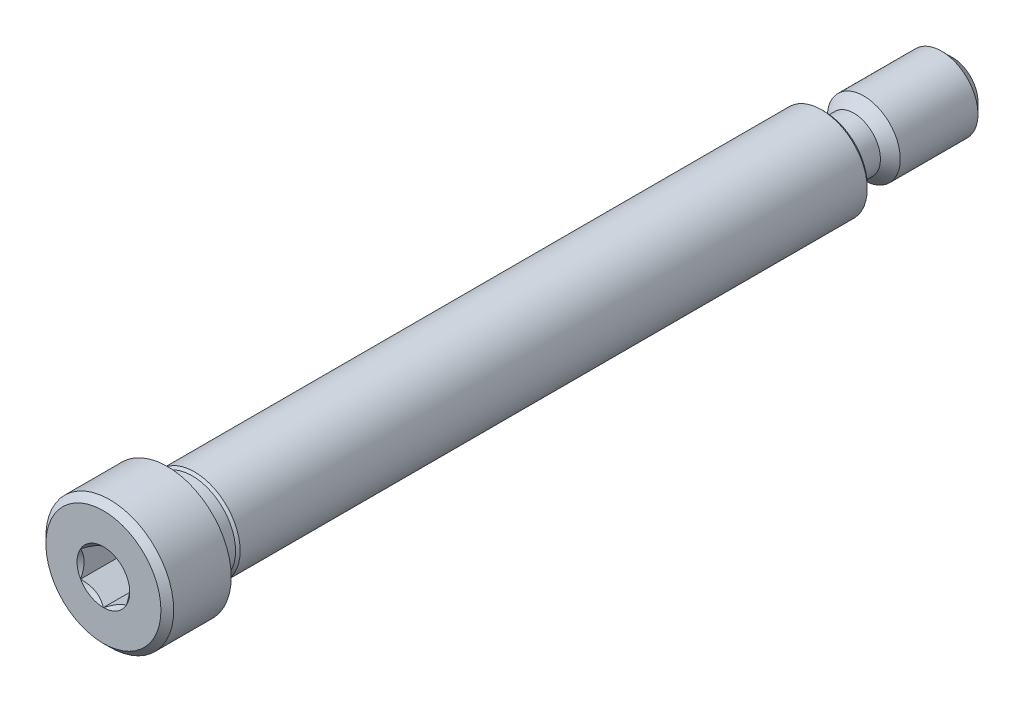
ISO-10303-21;
HEADER;
FILE_DESCRIPTION(('STEP AP214'),'2;1');
FILE_NAME('part.step','',(''),(''),'','','');
FILE_SCHEMA(('AUTOMOTIVE_DESIGN { 1 0 10303 214 1 1 1 1 }'));
ENDSEC;
DATA;
#1=APPLICATION_CONTEXT('core data for automotive mechanical design processes');
#2=APPLICATION_PROTOCOL_DEFINITION('international standard','automotive_design',2000,#1);
#3=PRODUCT_CONTEXT('',#1,'mechanical');
#4=PRODUCT('Part','Part','',(#3));
#5=PRODUCT_RELATED_PRODUCT_CATEGORY('part','',(#4));
#6=PRODUCT_DEFINITION_FORMATION('','',#4);
#7=PRODUCT_DEFINITION_CONTEXT('part definition',#1,'design');
#8=PRODUCT_DEFINITION('design','',#6,#7);
#9=PRODUCT_DEFINITION_SHAPE('','',#8);
#10=(LENGTH_UNIT() NAMED_UNIT(*) SI_UNIT(.MILLI.,.METRE.));
#11=(NAMED_UNIT(*) PLANE_ANGLE_UNIT() SI_UNIT($,.RADIAN.));
#12=(NAMED_UNIT(*) SI_UNIT($,.STERADIAN.) SOLID_ANGLE_UNIT());
#13=UNCERTAINTY_MEASURE_WITH_UNIT(LENGTH_MEASURE(1.E-05),#10,'distance_accuracy_value','');
#14=(GEOMETRIC_REPRESENTATION_CONTEXT(3) GLOBAL_UNCERTAINTY_ASSIGNED_CONTEXT((#13)) GLOBAL_UNIT_ASSIGNED_CONTEXT((#10,
#11,#12)) REPRESENTATION_CONTEXT('',''));
#15=CARTESIAN_POINT('',(0.,0.,0.));
#16=DIRECTION('',(0.,0.,1.));
#17=DIRECTION('',(1.,0.,0.));
#18=AXIS2_PLACEMENT_3D('',#15,#16,#17);
#19=CARTESIAN_POINT('',(0.,5.000625,36.909375));
#20=DIRECTION('',(0.,0.,-1.));
#21=DIRECTION('',(-1.,0.,0.));
#22=AXIS2_PLACEMENT_3D('',#19,#20,#21);
#23=PLANE('',#22);
#24=CARTESIAN_POINT('',(0.,0.,36.909375));
#25=DIRECTION('',(0.,0.,1.));
#26=DIRECTION('',(1.,0.,0.));
#27=AXIS2_PLACEMENT_3D('',#24,#25,#26);
#28=CIRCLE('',#27,2.29135888084633);
#29=CARTESIAN_POINT('',(-1.984375,1.14567944042316,36.909375));
#30=VERTEX_POINT('',#29);
#31=CARTESIAN_POINT('',(-1.984375,-1.14567944042316,36.909375));
#32=VERTEX_POINT('',#31);
#33=EDGE_CURVE('E132',#30,#32,#28,.T.);
#34=ORIENTED_EDGE('',*,*,#33,.F.);
#35=CARTESIAN_POINT('',(0.,2.29135888084633,36.909375));
#36=VERTEX_POINT('',#35);
#37=EDGE_CURVE('E127',#36,#30,#28,.T.);
#38=ORIENTED_EDGE('',*,*,#37,.F.);
#39=CARTESIAN_POINT('',(1.984375,1.14567944042317,36.909375));
#40=VERTEX_POINT('',#39);
#41=EDGE_CURVE('E99',#40,#36,#28,.T.);
#42=ORIENTED_EDGE('',*,*,#41,.F.);
#43=CARTESIAN_POINT('',(1.984375,-1.14567944042317,36.909375));
#44=VERTEX_POINT('',#43);
#45=EDGE_CURVE('E89',#44,#40,#28,.T.);
#46=ORIENTED_EDGE('',*,*,#45,.F.);
#47=CARTESIAN_POINT('',(0.,-2.29135888084633,36.909375));
#48=VERTEX_POINT('',#47);
#49=EDGE_CURVE('E50',#48,#44,#28,.T.);
#50=ORIENTED_EDGE('',*,*,#49,.F.);
#51=EDGE_CURVE('E57',#32,#48,#28,.T.);
#52=ORIENTED_EDGE('',*,*,#51,.F.);
#53=EDGE_LOOP('',(#34,#38,#42,#46,#50,#52));
#54=FACE_BOUND('',#53,.T.);
#55=CARTESIAN_POINT('',(0.,0.,36.909375));
#56=DIRECTION('',(0.,0.,1.));
#57=DIRECTION('',(1.,0.,0.));
#58=AXIS2_PLACEMENT_3D('',#55,#56,#57);
#59=CIRCLE('',#58,5.000625);
#60=CARTESIAN_POINT('',(5.000625,0.,36.909375));
#61=VERTEX_POINT('',#60);
#62=EDGE_CURVE('E44',#61,#61,#59,.T.);
#63=ORIENTED_EDGE('',*,*,#62,.T.);
#64=EDGE_LOOP('',(#63));
#65=FACE_BOUND('',#64,.T.);
#66=ADVANCED_FACE('F36',(#54,#65),#23,.F.);
#67=CARTESIAN_POINT('',(0.,0.,36.35375));
#68=DIRECTION('',(0.,0.,-1.));
#69=DIRECTION('',(-1.,0.,0.));
#70=AXIS2_PLACEMENT_3D('',#67,#68,#69);
#71=CONICAL_SURFACE('',#70,5.55625,0.785398163397445);
#72=ORIENTED_EDGE('',*,*,#62,.F.);
#73=EDGE_LOOP('',(#72));
#74=FACE_BOUND('',#73,.T.);
#75=CARTESIAN_POINT('',(0.,0.,36.35375));
#76=DIRECTION('',(0.,0.,1.));
#77=DIRECTION('',(1.,0.,0.));
#78=AXIS2_PLACEMENT_3D('',#75,#76,#77);
#79=CIRCLE('',#78,5.55625);
#80=CARTESIAN_POINT('',(5.55625,0.,36.35375));
#81=VERTEX_POINT('',#80);
#82=EDGE_CURVE('E301',#81,#81,#79,.T.);
#83=ORIENTED_EDGE('',*,*,#82,.T.);
#84=EDGE_LOOP('',(#83));
#85=FACE_BOUND('',#84,.T.);
#86=ADVANCED_FACE('F204',(#74,#85),#71,.T.);
#87=CARTESIAN_POINT('',(0.,0.,36.909375));
#88=DIRECTION('',(0.,0.,1.));
#89=DIRECTION('',(1.,0.,0.));
#90=AXIS2_PLACEMENT_3D('',#87,#88,#89);
#91=CYLINDRICAL_SURFACE('',#90,5.55625);
#92=ORIENTED_EDGE('',*,*,#82,.F.);
#93=EDGE_LOOP('',(#92));
#94=FACE_BOUND('',#93,.T.);
#95=CARTESIAN_POINT('',(0.,0.,31.353125));
#96=DIRECTION('',(0.,0.,1.));
#97=DIRECTION('',(1.,0.,0.));
#98=AXIS2_PLACEMENT_3D('',#95,#96,#97);
#99=CIRCLE('',#98,5.55625);
#100=CARTESIAN_POINT('',(5.55625,0.,31.353125));
#101=VERTEX_POINT('',#100);
#102=EDGE_CURVE('E298',#101,#101,#99,.T.);
#103=ORIENTED_EDGE('',*,*,#102,.T.);
#104=EDGE_LOOP('',(#103));
#105=FACE_BOUND('',#104,.T.);
#106=ADVANCED_FACE('F208',(#94,#105),#91,.T.);
#107=CARTESIAN_POINT('',(0.,5.55625,31.353125));
#108=DIRECTION('',(0.,0.,1.));
#109=DIRECTION('',(1.,0.,0.));
#110=AXIS2_PLACEMENT_3D('',#107,#108,#109);
#111=PLANE('',#110);
#112=ORIENTED_EDGE('',*,*,#102,.F.);
#113=EDGE_LOOP('',(#112));
#114=FACE_BOUND('',#113,.T.);
#115=CARTESIAN_POINT('',(0.,0.,31.353125));
#116=DIRECTION('',(0.,0.,1.));
#117=DIRECTION('',(1.,0.,0.));
#118=AXIS2_PLACEMENT_3D('',#115,#116,#117);
#119=CIRCLE('',#118,3.96875);
#120=CARTESIAN_POINT('',(3.96875,0.,31.353125));
#121=VERTEX_POINT('',#120);
#122=EDGE_CURVE('E295',#121,#121,#119,.T.);
#123=ORIENTED_EDGE('',*,*,#122,.T.);
#124=EDGE_LOOP('',(#123));
#125=FACE_BOUND('',#124,.T.);
#126=ADVANCED_FACE('F213',(#114,#125),#111,.F.);
#127=CARTESIAN_POINT('',(0.,0.,31.1546875));
#128=DIRECTION('',(0.,0.,1.));
#129=DIRECTION('',(1.,0.,0.));
#130=AXIS2_PLACEMENT_3D('',#127,#128,#129);
#131=CONICAL_SURFACE('',#130,3.7703125,0.785398163397443);
#132=ORIENTED_EDGE('',*,*,#122,.F.);
#133=EDGE_LOOP('',(#132));
#134=FACE_BOUND('',#133,.T.);
#135=CARTESIAN_POINT('',(0.,0.,31.1546875));
#136=DIRECTION('',(0.,0.,1.));
#137=DIRECTION('',(1.,0.,0.));
#138=AXIS2_PLACEMENT_3D('',#135,#136,#137);
#139=CIRCLE('',#138,3.7703125);
#140=CARTESIAN_POINT('',(3.7703125,0.,31.1546875));
#141=VERTEX_POINT('',#140);
#142=EDGE_CURVE('E292',#141,#141,#139,.T.);
#143=ORIENTED_EDGE('',*,*,#142,.T.);
#144=EDGE_LOOP('',(#143));
#145=FACE_BOUND('',#144,.T.);
#146=ADVANCED_FACE('F221',(#134,#145),#131,.T.);
#147=CARTESIAN_POINT('',(0.,0.,36.909375));
#148=DIRECTION('',(0.,0.,1.));
#149=DIRECTION('',(1.,0.,0.));
#150=AXIS2_PLACEMENT_3D('',#147,#148,#149);
#151=CYLINDRICAL_SURFACE('',#150,3.7703125);
#152=ORIENTED_EDGE('',*,*,#142,.F.);
#153=EDGE_LOOP('',(#152));
#154=FACE_BOUND('',#153,.T.);
#155=CARTESIAN_POINT('',(0.,0.,29.1893625));
#156=DIRECTION('',(0.,0.,1.));
#157=DIRECTION('',(1.,0.,0.));
#158=AXIS2_PLACEMENT_3D('',#155,#156,#157);
#159=CIRCLE('',#158,3.7703125);
#160=CARTESIAN_POINT('',(3.7703125,0.,29.1893625));
#161=VERTEX_POINT('',#160);
#162=EDGE_CURVE('E289',#161,#161,#159,.T.);
#163=ORIENTED_EDGE('',*,*,#162,.T.);
#164=EDGE_LOOP('',(#163));
#165=FACE_BOUND('',#164,.T.);
#166=ADVANCED_FACE('F225',(#154,#165),#151,.T.);
#167=CARTESIAN_POINT('',(0.,0.,28.990925));
#168=DIRECTION('',(0.,0.,-1.));
#169=DIRECTION('',(-1.,0.,0.));
#170=AXIS2_PLACEMENT_3D('',#167,#168,#169);
#171=CONICAL_SURFACE('',#170,3.96875,0.785398163397442);
#172=ORIENTED_EDGE('',*,*,#162,.F.);
#173=EDGE_LOOP('',(#172));
#174=FACE_BOUND('',#173,.T.);
#175=CARTESIAN_POINT('',(0.,0.,28.990925));
#176=DIRECTION('',(0.,0.,1.));
#177=DIRECTION('',(1.,0.,0.));
#178=AXIS2_PLACEMENT_3D('',#175,#176,#177);
#179=CIRCLE('',#178,3.96875);
#180=CARTESIAN_POINT('',(3.96875,0.,28.990925));
#181=VERTEX_POINT('',#180);
#182=EDGE_CURVE('E286',#181,#181,#179,.T.);
#183=ORIENTED_EDGE('',*,*,#182,.T.);
#184=EDGE_LOOP('',(#183));
#185=FACE_BOUND('',#184,.T.);
#186=ADVANCED_FACE('F229',(#174,#185),#171,.T.);
#187=CARTESIAN_POINT('',(0.,0.,36.909375));
#188=DIRECTION('',(0.,0.,1.));
#189=DIRECTION('',(1.,0.,0.));
#190=AXIS2_PLACEMENT_3D('',#187,#188,#189);
#191=CYLINDRICAL_SURFACE('',#190,3.96875);
#192=ORIENTED_EDGE('',*,*,#182,.F.);
#193=EDGE_LOOP('',(#192));
#194=FACE_BOUND('',#193,.T.);
#195=CARTESIAN_POINT('',(0.,0.,-25.5322916666667));
#196=DIRECTION('',(0.,0.,1.));
#197=DIRECTION('',(1.,0.,0.));
#198=AXIS2_PLACEMENT_3D('',#195,#196,#197);
#199=CIRCLE('',#198,3.96875);
#200=CARTESIAN_POINT('',(3.96875,0.,-25.5322916666667));
#201=VERTEX_POINT('',#200);
#202=EDGE_CURVE('E283',#201,#201,#199,.T.);
#203=ORIENTED_EDGE('',*,*,#202,.T.);
#204=EDGE_LOOP('',(#203));
#205=FACE_BOUND('',#204,.T.);
#206=ADVANCED_FACE('F233',(#194,#205),#191,.T.);
#207=CARTESIAN_POINT('',(0.,0.,-25.796875));
#208=DIRECTION('',(0.,0.,1.));
#209=DIRECTION('',(1.,0.,0.));
#210=AXIS2_PLACEMENT_3D('',#207,#208,#209);
#211=CONICAL_SURFACE('',#210,3.70416666666667,0.785398163397452);
#212=ORIENTED_EDGE('',*,*,#202,.F.);
#213=EDGE_LOOP('',(#212));
#214=FACE_BOUND('',#213,.T.);
#215=CARTESIAN_POINT('',(0.,0.,-25.796875));
#216=DIRECTION('',(0.,0.,1.));
#217=DIRECTION('',(1.,0.,0.));
#218=AXIS2_PLACEMENT_3D('',#215,#216,#217);
#219=CIRCLE('',#218,3.70416666666667);
#220=CARTESIAN_POINT('',(3.70416666666667,0.,-25.796875));
#221=VERTEX_POINT('',#220);
#222=EDGE_CURVE('E271',#221,#221,#219,.T.);
#223=ORIENTED_EDGE('',*,*,#222,.T.);
#224=EDGE_LOOP('',(#223));
#225=FACE_BOUND('',#224,.T.);
#226=ADVANCED_FACE('F237',(#214,#225),#211,.T.);
#227=CARTESIAN_POINT('',(0.,3.70416666666667,-25.796875));
#228=DIRECTION('',(0.,0.,1.));
#229=DIRECTION('',(1.,0.,0.));
#230=AXIS2_PLACEMENT_3D('',#227,#228,#229);
#231=PLANE('',#230);
#232=CARTESIAN_POINT('',(0.,0.,-25.796875));
#233=DIRECTION('',(0.,0.,-1.));
#234=DIRECTION('',(-1.,0.,0.));
#235=AXIS2_PLACEMENT_3D('',#232,#233,#234);
#236=CIRCLE('',#235,3.175);
#237=CARTESIAN_POINT('',(-3.175,0.,-25.796875));
#238=VERTEX_POINT('',#237);
#239=EDGE_CURVE('E527',#238,#238,#236,.T.);
#240=ORIENTED_EDGE('',*,*,#239,.F.);
#241=EDGE_LOOP('',(#240));
#242=FACE_BOUND('',#241,.T.);
#243=ORIENTED_EDGE('',*,*,#222,.F.);
#244=EDGE_LOOP('',(#243));
#245=FACE_BOUND('',#244,.T.);
#246=ADVANCED_FACE('F241',(#242,#245),#231,.F.);
#247=CARTESIAN_POINT('',(0.,0.,36.909375));
#248=DIRECTION('',(0.,0.,1.));
#249=DIRECTION('',(1.,0.,0.));
#250=AXIS2_PLACEMENT_3D('',#247,#248,#249);
#251=CONICAL_SURFACE('',#250,2.29135888084633,0.78539816339745);
#252=ORIENTED_EDGE('',*,*,#41,.T.);
#253=CARTESIAN_POINT('',(1.984575,1.14556397036933,36.9094904787818));
#254=CARTESIAN_POINT('',(1.91635900483319,1.18494849354192,36.8701378522639));
#255=CARTESIAN_POINT('',(1.84700231489303,1.22499159714897,36.8330963104462));
#256=CARTESIAN_POINT('',(1.70557619954781,1.30664400291398,36.7652738584233));
#257=CARTESIAN_POINT('',(1.63349332126322,1.34826107209555,36.7345306890918));
#258=CARTESIAN_POINT('',(1.488141602734,1.43217992591557,36.6818668888112));
#259=CARTESIAN_POINT('',(1.41490978751306,1.47446033414663,36.65981387588));
#260=CARTESIAN_POINT('',(1.2668338174053,1.55995203534886,36.6258364929439));
#261=CARTESIAN_POINT('',(1.19199418724658,1.60316071596705,36.6138867560917));
#262=CARTESIAN_POINT('',(1.06301458545619,1.6776271237807,36.6031050990819));
#263=CARTESIAN_POINT('',(1.00904128422756,1.7087886237741,36.6015088990591));
#264=CARTESIAN_POINT('',(0.9011828814802,1.77106070163465,36.6041968388653));
#265=CARTESIAN_POINT('',(0.847297817514477,1.80217125782056,36.6084830403405));
#266=CARTESIAN_POINT('',(0.740036461751397,1.86409863044402,36.6226918730135));
#267=CARTESIAN_POINT('',(0.68666080723986,1.89491507894443,36.6326208104523));
#268=CARTESIAN_POINT('',(0.580832482591104,1.95601509066828,36.6575700842745));
#269=CARTESIAN_POINT('',(0.528379742028899,1.9862986945516,36.6725900303895));
#270=CARTESIAN_POINT('',(0.394017661036352,2.06387267818152,36.7171828516357));
#271=CARTESIAN_POINT('',(0.312941642841677,2.11068193911104,36.7501179959383));
#272=CARTESIAN_POINT('',(0.193726693270163,2.17951072233758,36.8057174412022));
#273=CARTESIAN_POINT('',(0.154440075614001,2.20219286161692,36.8252525920519));
#274=CARTESIAN_POINT('',(0.0765946381319502,2.24713694590237,36.8661037381194));
#275=CARTESIAN_POINT('',(0.0380353888983047,2.26939913882716,36.8874186395684));
#276=CARTESIAN_POINT('',(-0.000199999999996856,2.29147435090016,36.9094904787818));
#277=B_SPLINE_CURVE_WITH_KNOTS('',3,(#253,#254,#255,#256,#257,#258,#259,#260,#261,#262,#263,
#264,#265,#266,#267,#268,#269,#270,#271,#272,#273,#274,#275,#276),.UNSPECIFIED.,.F.,.F.,(4,2,2,
2,2,2,2,2,2,2,2,4),(0.,0.264339630306627,0.530219665093692,0.791876416371457,1.05287424418109,
1.239639843932,1.42647091743852,1.61351120244034,1.8005371524754,2.09764209964316,
2.24579179873713,2.39385111134157),.UNSPECIFIED.);
#278=EDGE_CURVE('E11',#40,#36,#277,.T.);
#279=ORIENTED_EDGE('',*,*,#278,.F.);
#280=EDGE_LOOP('',(#252,#279));
#281=FACE_BOUND('',#280,.T.);
#282=ADVANCED_FACE('F102',(#281),#251,.F.);
#283=ORIENTED_EDGE('',*,*,#37,.T.);
#284=CARTESIAN_POINT('',(0.000200000000000114,2.29147435090017,36.9094904787818));
#285=CARTESIAN_POINT('',(-0.0680159951668045,2.25208982772757,36.8701378522639));
#286=CARTESIAN_POINT('',(-0.137372685106969,2.21204672412052,36.8330963104462));
#287=CARTESIAN_POINT('',(-0.278798800452189,2.13039431835551,36.7652738584233));
#288=CARTESIAN_POINT('',(-0.350881678736783,2.08877724917394,36.7345306890918));
#289=CARTESIAN_POINT('',(-0.496233397266004,2.00485839535392,36.6818668888112));
#290=CARTESIAN_POINT('',(-0.569465212486938,1.96257798712287,36.65981387588));
#291=CARTESIAN_POINT('',(-0.717541182594707,1.87708628592063,36.6258364929439));
#292=CARTESIAN_POINT('',(-0.792380812753425,1.83387760530244,36.6138867560917));
#293=CARTESIAN_POINT('',(-0.921360414543817,1.75941119748879,36.6031050990819));
#294=CARTESIAN_POINT('',(-0.975333715772444,1.72824969749539,36.6015088990591));
#295=CARTESIAN_POINT('',(-1.0831921185198,1.66597761963484,36.6041968388653));
#296=CARTESIAN_POINT('',(-1.13707718248552,1.63486706344893,36.6084830403405));
#297=CARTESIAN_POINT('',(-1.24433853824861,1.57293969082547,36.6226918730135));
#298=CARTESIAN_POINT('',(-1.29771419276014,1.54212324232506,36.6326208104523));
#299=CARTESIAN_POINT('',(-1.4035425174089,1.48102323060122,36.6575700842745));
#300=CARTESIAN_POINT('',(-1.4559952579711,1.45073962671789,36.6725900303895));
#301=CARTESIAN_POINT('',(-1.59035733896365,1.37316564308797,36.7171828516357));
#302=CARTESIAN_POINT('',(-1.67143335715833,1.32635638215845,36.7501179959383));
#303=CARTESIAN_POINT('',(-1.79064830672984,1.25752759893191,36.8057174412022));
#304=CARTESIAN_POINT('',(-1.829934924386,1.23484545965257,36.8252525920519));
#305=CARTESIAN_POINT('',(-1.90778036186805,1.18990137536713,36.8661037381194));
#306=CARTESIAN_POINT('',(-1.9463396111017,1.16763918244233,36.8874186395684));
#307=CARTESIAN_POINT('',(-1.984575,1.14556397036933,36.9094904787818));
#308=B_SPLINE_CURVE_WITH_KNOTS('',3,(#284,#285,#286,#287,#288,#289,#290,#291,#292,#293,#294,
#295,#296,#297,#298,#299,#300,#301,#302,#303,#304,#305,#306,#307),.UNSPECIFIED.,.F.,.F.,(4,2,2,
2,2,2,2,2,2,2,2,4),(0.,0.264339630306628,0.530219665093694,0.79187641637146,1.05287424418109,
1.239639843932,1.42647091743852,1.61351120244035,1.8005371524754,2.09764209964317,
2.24579179873714,2.39385111134157),.UNSPECIFIED.);
#309=EDGE_CURVE('E128',#36,#30,#308,.T.);
#310=ORIENTED_EDGE('',*,*,#309,.F.);
#311=EDGE_LOOP('',(#283,#310));
#312=FACE_BOUND('',#311,.T.);
#313=ADVANCED_FACE('F334',(#312),#251,.F.);
#314=ORIENTED_EDGE('',*,*,#33,.T.);
#315=CARTESIAN_POINT('',(-1.984375,-2.28495242157822,37.6443590788166));
#316=CARTESIAN_POINT('',(-1.984375,-2.22931635455401,37.6023616855508));
#317=CARTESIAN_POINT('',(-1.984375,-2.17336876548389,37.5607710540763));
#318=CARTESIAN_POINT('',(-1.984375,-2.0607277025817,37.4785834614715));
#319=CARTESIAN_POINT('',(-1.984375,-2.00403404503434,37.437986752405));
#320=CARTESIAN_POINT('',(-1.984375,-1.88936329173488,37.3576785031747));
#321=CARTESIAN_POINT('',(-1.984375,-1.83137965519348,37.3179762588133));
#322=CARTESIAN_POINT('',(-1.984375,-1.7144280213784,37.2400601734013));
#323=CARTESIAN_POINT('',(-1.984375,-1.65546009407228,37.2018462271944));
#324=CARTESIAN_POINT('',(-1.984375,-1.47005472306035,37.0856278340136));
#325=CARTESIAN_POINT('',(-1.984375,-1.34163909427883,37.0107228868724));
#326=CARTESIAN_POINT('',(-1.984375,-1.07840384705479,36.8737052154397));
#327=CARTESIAN_POINT('',(-1.984375,-0.943607781407422,36.8115493664824));
#328=CARTESIAN_POINT('',(-1.984375,-0.74127510044488,36.7355075786886));
#329=CARTESIAN_POINT('',(-1.984375,-0.676735408881094,36.713683061326));
#330=CARTESIAN_POINT('',(-1.984375,-0.54609811811276,36.6752154635378));
#331=CARTESIAN_POINT('',(-1.984375,-0.480000411919954,36.6585727400656));
#332=CARTESIAN_POINT('',(-1.984375,-0.347746170028529,36.6316103808697));
#333=CARTESIAN_POINT('',(-1.984375,-0.281612071479119,36.6211824097359));
#334=CARTESIAN_POINT('',(-1.984375,-0.148636620052346,36.6068531473766));
#335=CARTESIAN_POINT('',(-1.984375,-0.0817953907393188,36.6029507342274));
#336=CARTESIAN_POINT('',(-1.984375,0.0495156750890701,36.6019620513327));
#337=CARTESIAN_POINT('',(-1.984375,0.113983775102997,36.604634178875));
#338=CARTESIAN_POINT('',(-1.984375,0.242367515846183,36.6161142104975));
#339=CARTESIAN_POINT('',(-1.984375,0.306283102295925,36.6249227106392));
#340=CARTESIAN_POINT('',(-1.984375,0.43418104026219,36.6483440213329));
#341=CARTESIAN_POINT('',(-1.984375,0.498145026858316,36.6630556062321));
#342=CARTESIAN_POINT('',(-1.984375,0.624675616953013,36.6975011814121));
#343=CARTESIAN_POINT('',(-1.984375,0.687242336899694,36.7172347514492));
#344=CARTESIAN_POINT('',(-1.984375,0.884225483826092,36.7867872372308));
#345=CARTESIAN_POINT('',(-1.984375,1.01583674256469,36.8445274112565));
#346=CARTESIAN_POINT('',(-1.984375,1.27288659242652,36.9729053365888));
#347=CARTESIAN_POINT('',(-1.984375,1.3983008827048,37.0435894249194));
#348=CARTESIAN_POINT('',(-1.984375,1.57956687990222,37.1538916638132));
#349=CARTESIAN_POINT('',(-1.984375,1.63738271299425,37.1903448294754));
#350=CARTESIAN_POINT('',(-1.984375,1.75202215386203,37.2647909632917));
#351=CARTESIAN_POINT('',(-1.984375,1.80884568601363,37.3027840480781));
#352=CARTESIAN_POINT('',(-1.984375,1.92116923084256,37.3797138088931));
#353=CARTESIAN_POINT('',(-1.984375,1.97667624512255,37.4186403130388));
#354=CARTESIAN_POINT('',(-1.984375,2.08693170717168,37.4975227461214));
#355=CARTESIAN_POINT('',(-1.984375,2.14168035934794,37.537478389024));
#356=CARTESIAN_POINT('',(-1.984375,2.19611149046623,37.5778556112854));
#357=B_SPLINE_CURVE_WITH_KNOTS('',3,(#315,#316,#317,#318,#319,#320,#321,#322,#323,#324,#325,
#326,#327,#328,#329,#330,#331,#332,#333,#334,#335,#336,#337,#338,#339,#340,#341,#342,#343,#344,
#345,#346,#347,#348,#349,#350,#351,#352,#353,#354,#355,#356),.UNSPECIFIED.,.F.,.F.,(4,2,2,2,2,2,
2,2,2,2,2,2,2,2,2,2,2,2,2,2,4),(0.,0.209126070008321,0.418304637356568,0.629103979977992,
0.839888401371176,1.28549951116127,1.72957750768351,1.93379389749971,2.13802435186698,
2.33858179514333,2.53910475350639,2.73236963400794,2.92565329006887,3.12231577097487,
3.31896180041345,3.74886295245172,4.18033428125363,4.3853601718029,4.59040161996383,
4.79377749165109,4.99709743524132),.UNSPECIFIED.);
#358=EDGE_CURVE('E130',#30,#32,#357,.F.);
#359=ORIENTED_EDGE('',*,*,#358,.F.);
#360=EDGE_LOOP('',(#314,#359));
#361=FACE_BOUND('',#360,.T.);
#362=ADVANCED_FACE('F327',(#361),#251,.F.);
#363=ORIENTED_EDGE('',*,*,#51,.T.);
#364=CARTESIAN_POINT('',(-1.984575,-1.14556397036933,36.9094904787818));
#365=CARTESIAN_POINT('',(-1.9163590048332,-1.18494849354192,36.8701378522639));
#366=CARTESIAN_POINT('',(-1.84700231489303,-1.22499159714897,36.8330963104462));
#367=CARTESIAN_POINT('',(-1.70557619954781,-1.30664400291398,36.7652738584233));
#368=CARTESIAN_POINT('',(-1.63349332126322,-1.34826107209555,36.7345306890918));
#369=CARTESIAN_POINT('',(-1.488141602734,-1.43217992591557,36.6818668888112));
#370=CARTESIAN_POINT('',(-1.41490978751306,-1.47446033414663,36.65981387588));
#371=CARTESIAN_POINT('',(-1.26683381740529,-1.55995203534886,36.6258364929439));
#372=CARTESIAN_POINT('',(-1.19199418724657,-1.60316071596705,36.6138867560917));
#373=CARTESIAN_POINT('',(-1.06301458545618,-1.6776271237807,36.6031050990819));
#374=CARTESIAN_POINT('',(-1.00904128422755,-1.7087886237741,36.6015088990591));
#375=CARTESIAN_POINT('',(-0.901182881480196,-1.77106070163465,36.6041968388653));
#376=CARTESIAN_POINT('',(-0.847297817514473,-1.80217125782056,36.6084830403405));
#377=CARTESIAN_POINT('',(-0.740036461751393,-1.86409863044402,36.6226918730135));
#378=CARTESIAN_POINT('',(-0.686660807239856,-1.89491507894443,36.6326208104523));
#379=CARTESIAN_POINT('',(-0.5808324825911,-1.95601509066828,36.6575700842745));
#380=CARTESIAN_POINT('',(-0.528379742028895,-1.9862986945516,36.6725900303895));
#381=CARTESIAN_POINT('',(-0.394017661036349,-2.06387267818153,36.7171828516357));
#382=CARTESIAN_POINT('',(-0.312941642841674,-2.11068193911104,36.7501179959383));
#383=CARTESIAN_POINT('',(-0.193726693270161,-2.17951072233758,36.8057174412022));
#384=CARTESIAN_POINT('',(-0.154440075614,-2.20219286161692,36.8252525920519));
#385=CARTESIAN_POINT('',(-0.0765946381319492,-2.24713694590237,36.8661037381194));
#386=CARTESIAN_POINT('',(-0.0380353888983039,-2.26939913882716,36.8874186395683));
#387=CARTESIAN_POINT('',(0.000199999999997345,-2.29147435090016,36.9094904787818));
#388=B_SPLINE_CURVE_WITH_KNOTS('',3,(#364,#365,#366,#367,#368,#369,#370,#371,#372,#373,#374,
#375,#376,#377,#378,#379,#380,#381,#382,#383,#384,#385,#386,#387),.UNSPECIFIED.,.F.,.F.,(4,2,2,
2,2,2,2,2,2,2,2,4),(0.,0.264339630306628,0.530219665093695,0.791876416371461,1.05287424418109,
1.239639843932,1.42647091743853,1.61351120244035,1.80053715247541,2.09764209964316,
2.24579179873713,2.39385111134157),.UNSPECIFIED.);
#389=EDGE_CURVE('E170',#32,#48,#388,.T.);
#390=ORIENTED_EDGE('',*,*,#389,.F.);
#391=EDGE_LOOP('',(#363,#390));
#392=FACE_BOUND('',#391,.T.);
#393=ADVANCED_FACE('F328',(#392),#251,.F.);
#394=ORIENTED_EDGE('',*,*,#49,.T.);
#395=CARTESIAN_POINT('',(-0.000200000000000085,-2.29147435090017,36.9094904787818));
#396=CARTESIAN_POINT('',(0.0680159951668043,-2.25208982772757,36.8701378522639));
#397=CARTESIAN_POINT('',(0.137372685106968,-2.21204672412052,36.8330963104462));
#398=CARTESIAN_POINT('',(0.278798800452189,-2.13039431835551,36.7652738584233));
#399=CARTESIAN_POINT('',(0.350881678736783,-2.08877724917394,36.7345306890918));
#400=CARTESIAN_POINT('',(0.496233397266003,-2.00485839535392,36.6818668888112));
#401=CARTESIAN_POINT('',(0.569465212486938,-1.96257798712287,36.65981387588));
#402=CARTESIAN_POINT('',(0.717541182594707,-1.87708628592063,36.6258364929439));
#403=CARTESIAN_POINT('',(0.792380812753426,-1.83387760530244,36.6138867560917));
#404=CARTESIAN_POINT('',(0.921360414543817,-1.75941119748879,36.6031050990819));
#405=CARTESIAN_POINT('',(0.975333715772444,-1.72824969749539,36.6015088990591));
#406=CARTESIAN_POINT('',(1.0831921185198,-1.66597761963484,36.6041968388653));
#407=CARTESIAN_POINT('',(1.13707718248553,-1.63486706344893,36.6084830403405));
#408=CARTESIAN_POINT('',(1.24433853824861,-1.57293969082547,36.6226918730135));
#409=CARTESIAN_POINT('',(1.29771419276014,-1.54212324232506,36.6326208104523));
#410=CARTESIAN_POINT('',(1.4035425174089,-1.48102323060122,36.6575700842745));
#411=CARTESIAN_POINT('',(1.4559952579711,-1.45073962671789,36.6725900303895));
#412=CARTESIAN_POINT('',(1.59035733896365,-1.37316564308797,36.7171828516357));
#413=CARTESIAN_POINT('',(1.67143335715832,-1.32635638215845,36.7501179959383));
#414=CARTESIAN_POINT('',(1.79064830672984,-1.25752759893191,36.8057174412022));
#415=CARTESIAN_POINT('',(1.829934924386,-1.23484545965257,36.8252525920519));
#416=CARTESIAN_POINT('',(1.90778036186805,-1.18990137536713,36.8661037381194));
#417=CARTESIAN_POINT('',(1.9463396111017,-1.16763918244233,36.8874186395683));
#418=CARTESIAN_POINT('',(1.984575,-1.14556397036933,36.9094904787818));
#419=B_SPLINE_CURVE_WITH_KNOTS('',3,(#395,#396,#397,#398,#399,#400,#401,#402,#403,#404,#405,
#406,#407,#408,#409,#410,#411,#412,#413,#414,#415,#416,#417,#418),.UNSPECIFIED.,.F.,.F.,(4,2,2,
2,2,2,2,2,2,2,2,4),(0.,0.264339630306628,0.530219665093694,0.79187641637146,1.05287424418109,
1.239639843932,1.42647091743852,1.61351120244035,1.8005371524754,2.09764209964316,
2.24579179873713,2.39385111134157),.UNSPECIFIED.);
#420=EDGE_CURVE('E114',#48,#44,#419,.T.);
#421=ORIENTED_EDGE('',*,*,#420,.F.);
#422=EDGE_LOOP('',(#394,#421));
#423=FACE_BOUND('',#422,.T.);
#424=ADVANCED_FACE('F156',(#423),#251,.F.);
#425=ORIENTED_EDGE('',*,*,#45,.T.);
#426=CARTESIAN_POINT('',(1.984375,-2.28495242191066,37.6443590790676));
#427=CARTESIAN_POINT('',(1.984375,-2.22931635487713,37.6023616857921));
#428=CARTESIAN_POINT('',(1.984375,-2.17336876579765,37.560771054308));
#429=CARTESIAN_POINT('',(1.984375,-2.06072770287666,37.4785834616839));
#430=CARTESIAN_POINT('',(1.984375,-2.00403404531985,37.4379867526079));
#431=CARTESIAN_POINT('',(1.984375,-1.88936329200117,37.3576785033582));
#432=CARTESIAN_POINT('',(1.984375,-1.83137965544999,37.3179762589872));
#433=CARTESIAN_POINT('',(1.984375,-1.71442802161519,37.240060173556));
#434=CARTESIAN_POINT('',(1.984375,-1.65546009429911,37.2018462273396));
#435=CARTESIAN_POINT('',(1.984375,-1.47005472325436,37.0856278341287));
#436=CARTESIAN_POINT('',(1.984375,-1.34163909444949,37.0107228869673));
#437=CARTESIAN_POINT('',(1.984375,-1.07840384717678,36.8737052154972));
#438=CARTESIAN_POINT('',(1.984375,-0.943607781504094,36.8115493665226));
#439=CARTESIAN_POINT('',(1.984375,-0.741275100522506,36.735507578716));
#440=CARTESIAN_POINT('',(1.984375,-0.676735408966694,36.7136830613539));
#441=CARTESIAN_POINT('',(1.984375,-0.546098118214572,36.6752154635651));
#442=CARTESIAN_POINT('',(1.984375,-0.480000412030003,36.6585727400917));
#443=CARTESIAN_POINT('',(1.984375,-0.347746170154779,36.6316103808918));
#444=CARTESIAN_POINT('',(1.984375,-0.281612071613331,36.621182409755));
#445=CARTESIAN_POINT('',(1.984375,-0.148636620202213,36.6068531473881));
#446=CARTESIAN_POINT('',(1.984375,-0.0817953908968822,36.6029507342341));
#447=CARTESIAN_POINT('',(1.984375,0.0495156749173087,36.6019620513286));
#448=CARTESIAN_POINT('',(1.984375,0.113983774924714,36.604634178865));
#449=CARTESIAN_POINT('',(1.984375,0.242367515655507,36.6161142104746));
#450=CARTESIAN_POINT('',(1.984375,0.306283102099381,36.6249227106094));
#451=CARTESIAN_POINT('',(1.984375,0.434181040054057,36.6483440212885));
#452=CARTESIAN_POINT('',(1.984375,0.498145026644482,36.6630556061801));
#453=CARTESIAN_POINT('',(1.984375,0.624675616728329,36.6975011813447));
#454=CARTESIAN_POINT('',(1.984375,0.68724233666986,36.717234751374));
#455=CARTESIAN_POINT('',(1.984375,0.884225483546216,36.7867872371188));
#456=CARTESIAN_POINT('',(1.984375,1.01583674224242,36.8445274111108));
#457=CARTESIAN_POINT('',(1.984375,1.27288659202274,36.9729053363718));
#458=CARTESIAN_POINT('',(1.984375,1.39830088226191,37.0435894246649));
#459=CARTESIAN_POINT('',(1.984375,1.57956687940504,37.1538916635037));
#460=CARTESIAN_POINT('',(1.984375,1.63738271248119,37.1903448291489));
#461=CARTESIAN_POINT('',(1.984375,1.75202215331743,37.2647909629313));
#462=CARTESIAN_POINT('',(1.984375,1.80884568545337,37.3027840477007));
#463=CARTESIAN_POINT('',(1.984375,1.92116923025137,37.3797138084819));
#464=CARTESIAN_POINT('',(1.984375,1.97667624451607,37.4186403126108));
#465=CARTESIAN_POINT('',(1.984375,2.08693170653474,37.4975227456598));
#466=CARTESIAN_POINT('',(1.984375,2.14168035869582,37.5374783885457));
#467=CARTESIAN_POINT('',(1.984375,2.19611148979895,37.5778556107903));
#468=B_SPLINE_CURVE_WITH_KNOTS('',3,(#426,#427,#428,#429,#430,#431,#432,#433,#434,#435,#436,
#437,#438,#439,#440,#441,#442,#443,#444,#445,#446,#447,#448,#449,#450,#451,#452,#453,#454,#455,
#456,#457,#458,#459,#460,#461,#462,#463,#464,#465,#466,#467),.UNSPECIFIED.,.F.,.F.,(4,2,2,2,2,2,
2,2,2,2,2,2,2,2,2,2,2,2,2,2,4),(0.,0.209126070048123,0.418304637436185,0.62910398009817,
0.839888401531923,1.28549951141298,1.72957750802533,1.93379389781847,2.13802435216271,
2.33858179541698,2.53910475375795,2.73236963423929,2.92565329027999,3.12231577116421,
3.31896180058102,3.7488629524628,4.18033428110719,4.38536017158908,4.59040161968262,
4.7937774913034,4.99709743482716),.UNSPECIFIED.);
#469=EDGE_CURVE('E93',#44,#40,#468,.T.);
#470=ORIENTED_EDGE('',*,*,#469,.F.);
#471=EDGE_LOOP('',(#425,#470));
#472=FACE_BOUND('',#471,.T.);
#473=ADVANCED_FACE('F91',(#472),#251,.F.);
#474=CARTESIAN_POINT('',(0.,0.,32.7421875));
#475=DIRECTION('',(0.,0.,1.));
#476=DIRECTION('',(1.,0.,0.));
#477=AXIS2_PLACEMENT_3D('',#474,#475,#476);
#478=PLANE('',#477);
#479=DIRECTION('',(0.,1.,0.));
#480=VECTOR('',#479,1.);
#481=CARTESIAN_POINT('',(1.984375,-1.14567944042317,32.7421875));
#482=LINE('',#481,#480);
#483=CARTESIAN_POINT('',(1.984375,-1.14567944042317,32.7421875));
#484=VERTEX_POINT('',#483);
#485=CARTESIAN_POINT('',(1.984375,1.14567944042317,32.7421875));
#486=VERTEX_POINT('',#485);
#487=EDGE_CURVE('E113',#484,#486,#482,.T.);
#488=ORIENTED_EDGE('',*,*,#487,.T.);
#489=DIRECTION('',(-0.866025403784439,0.5,0.));
#490=VECTOR('',#489,1.);
#491=CARTESIAN_POINT('',(1.984375,1.14567944042317,32.7421875));
#492=LINE('',#491,#490);
#493=CARTESIAN_POINT('',(0.,2.29135888084633,32.7421875));
#494=VERTEX_POINT('',#493);
#495=EDGE_CURVE('E118',#486,#494,#492,.T.);
#496=ORIENTED_EDGE('',*,*,#495,.T.);
#497=DIRECTION('',(-0.866025403784439,-0.5,0.));
#498=VECTOR('',#497,1.);
#499=CARTESIAN_POINT('',(0.,2.29135888084633,32.7421875));
#500=LINE('',#499,#498);
#501=CARTESIAN_POINT('',(-1.984375,1.14567944042316,32.7421875));
#502=VERTEX_POINT('',#501);
#503=EDGE_CURVE('E260',#494,#502,#500,.T.);
#504=ORIENTED_EDGE('',*,*,#503,.T.);
#505=DIRECTION('',(0.,-1.,0.));
#506=VECTOR('',#505,1.);
#507=CARTESIAN_POINT('',(-1.984375,1.14567944042316,32.7421875));
#508=LINE('',#507,#506);
#509=CARTESIAN_POINT('',(-1.984375,-1.14567944042316,32.7421875));
#510=VERTEX_POINT('',#509);
#511=EDGE_CURVE('E264',#502,#510,#508,.T.);
#512=ORIENTED_EDGE('',*,*,#511,.T.);
#513=DIRECTION('',(0.866025403784439,-0.5,0.));
#514=VECTOR('',#513,1.);
#515=CARTESIAN_POINT('',(-1.984375,-1.14567944042316,32.7421875));
#516=LINE('',#515,#514);
#517=CARTESIAN_POINT('',(0.,-2.29135888084633,32.7421875));
#518=VERTEX_POINT('',#517);
#519=EDGE_CURVE('E267',#510,#518,#516,.T.);
#520=ORIENTED_EDGE('',*,*,#519,.T.);
#521=DIRECTION('',(0.866025403784439,0.5,0.));
#522=VECTOR('',#521,1.);
#523=CARTESIAN_POINT('',(0.,-2.29135888084633,32.7421875));
#524=LINE('',#523,#522);
#525=EDGE_CURVE('E121',#518,#484,#524,.T.);
#526=ORIENTED_EDGE('',*,*,#525,.T.);
#527=EDGE_LOOP('',(#488,#496,#504,#512,#520,#526));
#528=FACE_BOUND('',#527,.T.);
#529=ADVANCED_FACE('F155',(#528),#478,.T.);
#530=CARTESIAN_POINT('',(1.984375,1.14567944042317,32.7421875));
#531=DIRECTION('',(0.5,0.866025403784439,0.));
#532=DIRECTION('',(-0.866025403784439,0.5,0.));
#533=AXIS2_PLACEMENT_3D('',#530,#531,#532);
#534=PLANE('',#533);
#535=DIRECTION('',(0.,0.,1.));
#536=VECTOR('',#535,1.);
#537=CARTESIAN_POINT('',(1.984375,1.14567944042317,32.7421875));
#538=LINE('',#537,#536);
#539=EDGE_CURVE('E110',#486,#40,#538,.T.);
#540=ORIENTED_EDGE('',*,*,#539,.T.);
#541=ORIENTED_EDGE('',*,*,#278,.T.);
#542=DIRECTION('',(0.,0.,1.));
#543=VECTOR('',#542,1.);
#544=CARTESIAN_POINT('',(0.,2.29135888084633,32.7421875));
#545=LINE('',#544,#543);
#546=EDGE_CURVE('E120',#494,#36,#545,.T.);
#547=ORIENTED_EDGE('',*,*,#546,.F.);
#548=ORIENTED_EDGE('',*,*,#495,.F.);
#549=EDGE_LOOP('',(#540,#541,#547,#548));
#550=FACE_BOUND('',#549,.T.);
#551=ADVANCED_FACE('F116',(#550),#534,.F.);
#552=CARTESIAN_POINT('',(0.,2.29135888084633,32.7421875));
#553=DIRECTION('',(-0.5,0.866025403784439,0.));
#554=DIRECTION('',(-0.866025403784439,-0.5,0.));
#555=AXIS2_PLACEMENT_3D('',#552,#553,#554);
#556=PLANE('',#555);
#557=ORIENTED_EDGE('',*,*,#546,.T.);
#558=ORIENTED_EDGE('',*,*,#309,.T.);
#559=DIRECTION('',(0.,0.,1.));
#560=VECTOR('',#559,1.);
#561=CARTESIAN_POINT('',(-1.984375,1.14567944042316,32.7421875));
#562=LINE('',#561,#560);
#563=EDGE_CURVE('E278',#502,#30,#562,.T.);
#564=ORIENTED_EDGE('',*,*,#563,.F.);
#565=ORIENTED_EDGE('',*,*,#503,.F.);
#566=EDGE_LOOP('',(#557,#558,#564,#565));
#567=FACE_BOUND('',#566,.T.);
#568=ADVANCED_FACE('F148',(#567),#556,.F.);
#569=CARTESIAN_POINT('',(-1.984375,1.14567944042316,32.7421875));
#570=DIRECTION('',(-1.,0.,0.));
#571=DIRECTION('',(0.,-1.,0.));
#572=AXIS2_PLACEMENT_3D('',#569,#570,#571);
#573=PLANE('',#572);
#574=ORIENTED_EDGE('',*,*,#563,.T.);
#575=ORIENTED_EDGE('',*,*,#358,.T.);
#576=DIRECTION('',(0.,0.,1.));
#577=VECTOR('',#576,1.);
#578=CARTESIAN_POINT('',(-1.984375,-1.14567944042316,32.7421875));
#579=LINE('',#578,#577);
#580=EDGE_CURVE('E275',#510,#32,#579,.T.);
#581=ORIENTED_EDGE('',*,*,#580,.F.);
#582=ORIENTED_EDGE('',*,*,#511,.F.);
#583=EDGE_LOOP('',(#574,#575,#581,#582));
#584=FACE_BOUND('',#583,.T.);
#585=ADVANCED_FACE('F194',(#584),#573,.F.);
#586=CARTESIAN_POINT('',(-1.984375,-1.14567944042316,32.7421875));
#587=DIRECTION('',(-0.5,-0.866025403784439,0.));
#588=DIRECTION('',(0.866025403784439,-0.5,0.));
#589=AXIS2_PLACEMENT_3D('',#586,#587,#588);
#590=PLANE('',#589);
#591=ORIENTED_EDGE('',*,*,#580,.T.);
#592=ORIENTED_EDGE('',*,*,#389,.T.);
#593=DIRECTION('',(0.,0.,1.));
#594=VECTOR('',#593,1.);
#595=CARTESIAN_POINT('',(0.,-2.29135888084633,32.7421875));
#596=LINE('',#595,#594);
#597=EDGE_CURVE('E272',#518,#48,#596,.T.);
#598=ORIENTED_EDGE('',*,*,#597,.F.);
#599=ORIENTED_EDGE('',*,*,#519,.F.);
#600=EDGE_LOOP('',(#591,#592,#598,#599));
#601=FACE_BOUND('',#600,.T.);
#602=ADVANCED_FACE('F190',(#601),#590,.F.);
#603=CARTESIAN_POINT('',(0.,-2.29135888084633,32.7421875));
#604=DIRECTION('',(0.5,-0.866025403784439,0.));
#605=DIRECTION('',(0.866025403784439,0.5,0.));
#606=AXIS2_PLACEMENT_3D('',#603,#604,#605);
#607=PLANE('',#606);
#608=ORIENTED_EDGE('',*,*,#597,.T.);
#609=ORIENTED_EDGE('',*,*,#420,.T.);
#610=DIRECTION('',(0.,0.,1.));
#611=VECTOR('',#610,1.);
#612=CARTESIAN_POINT('',(1.984375,-1.14567944042317,32.7421875));
#613=LINE('',#612,#611);
#614=EDGE_CURVE('E112',#484,#44,#613,.T.);
#615=ORIENTED_EDGE('',*,*,#614,.F.);
#616=ORIENTED_EDGE('',*,*,#525,.F.);
#617=EDGE_LOOP('',(#608,#609,#615,#616));
#618=FACE_BOUND('',#617,.T.);
#619=ADVANCED_FACE('F187',(#618),#607,.F.);
#620=CARTESIAN_POINT('',(1.984375,-1.14567944042317,32.7421875));
#621=DIRECTION('',(1.,0.,0.));
#622=DIRECTION('',(0.,1.,0.));
#623=AXIS2_PLACEMENT_3D('',#620,#621,#622);
#624=PLANE('',#623);
#625=ORIENTED_EDGE('',*,*,#614,.T.);
#626=ORIENTED_EDGE('',*,*,#469,.T.);
#627=ORIENTED_EDGE('',*,*,#539,.F.);
#628=ORIENTED_EDGE('',*,*,#487,.F.);
#629=EDGE_LOOP('',(#625,#626,#627,#628));
#630=FACE_BOUND('',#629,.T.);
#631=ADVANCED_FACE('F108',(#630),#624,.F.);
#632=CARTESIAN_POINT('',(0.,0.,-26.660475));
#633=DIRECTION('',(0.,0.,-1.));
#634=DIRECTION('',(-1.,0.,0.));
#635=AXIS2_PLACEMENT_3D('',#632,#633,#634);
#636=TOROIDAL_SURFACE('',#635,3.175,0.8636);
#637=CARTESIAN_POINT('',(0.,0.,-26.660475));
#638=DIRECTION('',(0.,0.,-1.));
#639=DIRECTION('',(-1.,0.,0.));
#640=AXIS2_PLACEMENT_3D('',#637,#638,#639);
#641=CIRCLE('',#640,2.3114);
#642=CARTESIAN_POINT('',(-2.3114,0.,-26.660475));
#643=VERTEX_POINT('',#642);
#644=EDGE_CURVE('E526',#643,#643,#641,.T.);
#645=ORIENTED_EDGE('',*,*,#644,.F.);
#646=EDGE_LOOP('',(#645));
#647=FACE_BOUND('',#646,.T.);
#648=ORIENTED_EDGE('',*,*,#239,.T.);
#649=EDGE_LOOP('',(#648));
#650=FACE_BOUND('',#649,.T.);
#651=ADVANCED_FACE('F247',(#647,#650),#636,.F.);
#652=CARTESIAN_POINT('',(0.,0.,-36.909375));
#653=DIRECTION('',(0.,0.,-1.));
#654=DIRECTION('',(-1.,0.,0.));
#655=AXIS2_PLACEMENT_3D('',#652,#653,#654);
#656=CYLINDRICAL_SURFACE('',#655,2.3114);
#657=CARTESIAN_POINT('',(0.,0.,-28.336875));
#658=DIRECTION('',(0.,0.,-1.));
#659=DIRECTION('',(-1.,0.,0.));
#660=AXIS2_PLACEMENT_3D('',#657,#658,#659);
#661=CIRCLE('',#660,2.3114);
#662=CARTESIAN_POINT('',(-2.3114,0.,-28.336875));
#663=VERTEX_POINT('',#662);
#664=EDGE_CURVE('E525',#663,#663,#661,.T.);
#665=ORIENTED_EDGE('',*,*,#664,.F.);
#666=EDGE_LOOP('',(#665));
#667=FACE_BOUND('',#666,.T.);
#668=ORIENTED_EDGE('',*,*,#644,.T.);
#669=EDGE_LOOP('',(#668));
#670=FACE_BOUND('',#669,.T.);
#671=ADVANCED_FACE('F453',(#667,#670),#656,.T.);
#672=CARTESIAN_POINT('',(0.,0.,-28.336875));
#673=DIRECTION('',(0.,0.,-1.));
#674=DIRECTION('',(-1.,0.,0.));
#675=AXIS2_PLACEMENT_3D('',#672,#673,#674);
#676=CONICAL_SURFACE('',#675,2.3114,0.785398163397442);
#677=CARTESIAN_POINT('',(0.,0.,-29.200475));
#678=DIRECTION('',(0.,0.,-1.));
#679=DIRECTION('',(-1.,0.,0.));
#680=AXIS2_PLACEMENT_3D('',#677,#678,#679);
#681=CIRCLE('',#680,3.175);
#682=CARTESIAN_POINT('',(-3.175,0.,-29.200475));
#683=VERTEX_POINT('',#682);
#684=EDGE_CURVE('E39',#683,#683,#681,.F.);
#685=ORIENTED_EDGE('',*,*,#684,.T.);
#686=EDGE_LOOP('',(#685));
#687=FACE_BOUND('',#686,.T.);
#688=ORIENTED_EDGE('',*,*,#664,.T.);
#689=EDGE_LOOP('',(#688));
#690=FACE_BOUND('',#689,.T.);
#691=ADVANCED_FACE('F444',(#687,#690),#676,.T.);
#692=CARTESIAN_POINT('',(0.,2.22249999999999,-36.909375));
#693=DIRECTION('',(0.,0.,-1.));
#694=DIRECTION('',(-1.,0.,0.));
#695=AXIS2_PLACEMENT_3D('',#692,#693,#694);
#696=PLANE('',#695);
#697=CARTESIAN_POINT('',(0.,0.,-36.909375));
#698=DIRECTION('',(0.,0.,-1.));
#699=DIRECTION('',(-1.,0.,0.));
#700=AXIS2_PLACEMENT_3D('',#697,#698,#699);
#701=CIRCLE('',#700,2.22249999999999);
#702=CARTESIAN_POINT('',(-2.22249999999999,0.,-36.909375));
#703=VERTEX_POINT('',#702);
#704=EDGE_CURVE('E533',#703,#703,#701,.T.);
#705=ORIENTED_EDGE('',*,*,#704,.T.);
#706=EDGE_LOOP('',(#705));
#707=FACE_BOUND('',#706,.T.);
#708=ADVANCED_FACE('F436',(#707),#696,.T.);
#709=CARTESIAN_POINT('',(0.,0.,-36.909375));
#710=DIRECTION('',(0.,0.,1.));
#711=DIRECTION('',(1.,0.,0.));
#712=AXIS2_PLACEMENT_3D('',#709,#710,#711);
#713=CONICAL_SURFACE('',#712,2.22249999999999,0.785398163397454);
#714=CARTESIAN_POINT('',(0.,0.,-35.956875));
#715=DIRECTION('',(0.,0.,-1.));
#716=DIRECTION('',(-1.,0.,0.));
#717=AXIS2_PLACEMENT_3D('',#714,#715,#716);
#718=CIRCLE('',#717,3.175);
#719=CARTESIAN_POINT('',(-3.175,0.,-35.956875));
#720=VERTEX_POINT('',#719);
#721=EDGE_CURVE('E97',#720,#720,#718,.T.);
#722=ORIENTED_EDGE('',*,*,#721,.T.);
#723=EDGE_LOOP('',(#722));
#724=FACE_BOUND('',#723,.T.);
#725=ORIENTED_EDGE('',*,*,#704,.F.);
#726=EDGE_LOOP('',(#725));
#727=FACE_BOUND('',#726,.T.);
#728=ADVANCED_FACE('F428',(#724,#727),#713,.T.);
#729=CARTESIAN_POINT('',(0.,0.,-36.909375));
#730=DIRECTION('',(0.,0.,-1.));
#731=DIRECTION('',(-1.,0.,0.));
#732=AXIS2_PLACEMENT_3D('',#729,#730,#731);
#733=CYLINDRICAL_SURFACE('',#732,3.175);
#734=ORIENTED_EDGE('',*,*,#684,.F.);
#735=EDGE_LOOP('',(#734));
#736=FACE_BOUND('',#735,.T.);
#737=ORIENTED_EDGE('',*,*,#721,.F.);
#738=EDGE_LOOP('',(#737));
#739=FACE_BOUND('',#738,.T.);
#740=ADVANCED_FACE('F157',(#736,#739),#733,.T.);
#741=CLOSED_SHELL('',(#66,#86,#106,#126,#146,#166,#186,#206,#226,#246,#282,#313,#362,#393,#424,
#473,#529,#551,#568,#585,#602,#619,#631,#651,#671,#691,#708,#728,#740));
#742=MANIFOLD_SOLID_BREP('B2',#741);
#743=ADVANCED_BREP_SHAPE_REPRESENTATION('',(#18,#742),#14);
#744=SHAPE_DEFINITION_REPRESENTATION(#9,#743);
ENDSEC;
END-ISO-10303-21;
